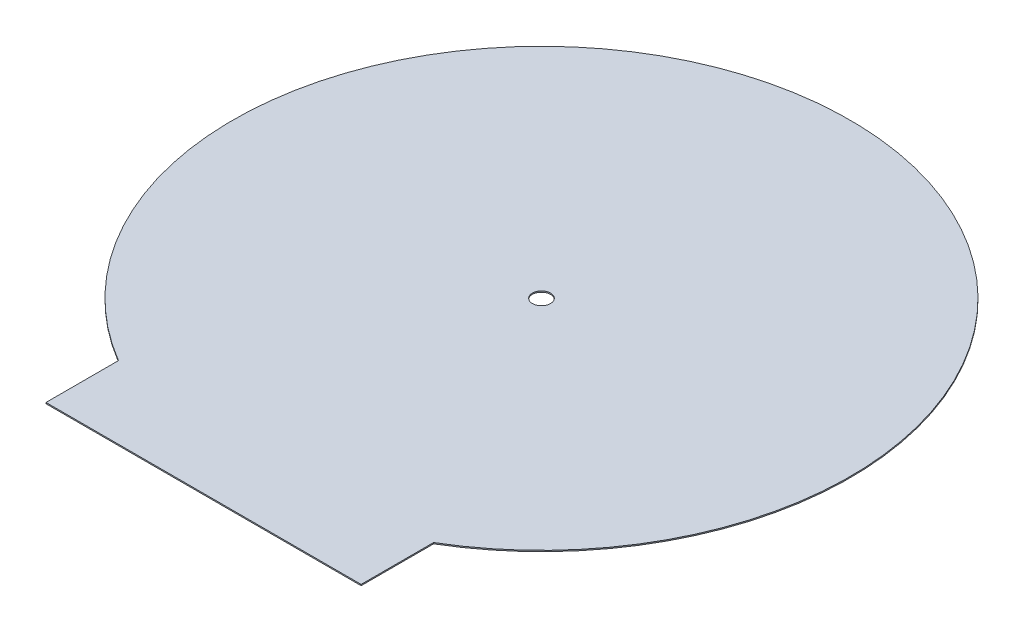
ISO-10303-21;
HEADER;
FILE_DESCRIPTION(('STEP AP214'),'2;1');
FILE_NAME('part.step','',(''),(''),'','','');
FILE_SCHEMA(('AUTOMOTIVE_DESIGN { 1 0 10303 214 1 1 1 1 }'));
ENDSEC;
DATA;
#1=APPLICATION_CONTEXT('core data for automotive mechanical design processes');
#2=APPLICATION_PROTOCOL_DEFINITION('international standard','automotive_design',2000,#1);
#3=PRODUCT_CONTEXT('',#1,'mechanical');
#4=PRODUCT('Part','Part','',(#3));
#5=PRODUCT_RELATED_PRODUCT_CATEGORY('part','',(#4));
#6=PRODUCT_DEFINITION_FORMATION('','',#4);
#7=PRODUCT_DEFINITION_CONTEXT('part definition',#1,'design');
#8=PRODUCT_DEFINITION('design','',#6,#7);
#9=PRODUCT_DEFINITION_SHAPE('','',#8);
#10=(LENGTH_UNIT() NAMED_UNIT(*) SI_UNIT(.MILLI.,.METRE.));
#11=(NAMED_UNIT(*) PLANE_ANGLE_UNIT() SI_UNIT($,.RADIAN.));
#12=(NAMED_UNIT(*) SI_UNIT($,.STERADIAN.) SOLID_ANGLE_UNIT());
#13=UNCERTAINTY_MEASURE_WITH_UNIT(LENGTH_MEASURE(1.E-05),#10,'distance_accuracy_value','');
#14=(GEOMETRIC_REPRESENTATION_CONTEXT(3) GLOBAL_UNCERTAINTY_ASSIGNED_CONTEXT((#13)) GLOBAL_UNIT_ASSIGNED_CONTEXT((#10,
#11,#12)) REPRESENTATION_CONTEXT('',''));
#15=CARTESIAN_POINT('',(0.,0.,0.));
#16=DIRECTION('',(0.,0.,1.));
#17=DIRECTION('',(1.,0.,0.));
#18=AXIS2_PLACEMENT_3D('',#15,#16,#17);
#19=CARTESIAN_POINT('',(-269.,851.,576.88772659299));
#20=DIRECTION('',(-1.,0.,0.));
#21=DIRECTION('',(0.,0.,1.));
#22=AXIS2_PLACEMENT_3D('',#19,#20,#21);
#23=PLANE('',#22);
#24=DIRECTION('',(0.,0.,1.));
#25=VECTOR('',#24,1.);
#26=CARTESIAN_POINT('',(-269.,853.,576.88772659299));
#27=LINE('',#26,#25);
#28=CARTESIAN_POINT('',(-269.,853.,453.175462707327));
#29=VERTEX_POINT('',#28);
#30=CARTESIAN_POINT('',(-269.,853.,576.88772659299));
#31=VERTEX_POINT('',#30);
#32=EDGE_CURVE('E101',#29,#31,#27,.T.);
#33=ORIENTED_EDGE('',*,*,#32,.F.);
#34=DIRECTION('',(0.,1.,0.));
#35=VECTOR('',#34,1.);
#36=CARTESIAN_POINT('',(-269.,851.,453.175462707327));
#37=LINE('',#36,#35);
#38=CARTESIAN_POINT('',(-269.,851.,453.175462707327));
#39=VERTEX_POINT('',#38);
#40=EDGE_CURVE('E11',#39,#29,#37,.T.);
#41=ORIENTED_EDGE('',*,*,#40,.F.);
#42=DIRECTION('',(0.,0.,1.));
#43=VECTOR('',#42,1.);
#44=CARTESIAN_POINT('',(-269.,851.,576.88772659299));
#45=LINE('',#44,#43);
#46=CARTESIAN_POINT('',(-269.,851.,576.88772659299));
#47=VERTEX_POINT('',#46);
#48=EDGE_CURVE('E94',#39,#47,#45,.T.);
#49=ORIENTED_EDGE('',*,*,#48,.T.);
#50=DIRECTION('',(0.,1.,0.));
#51=VECTOR('',#50,1.);
#52=CARTESIAN_POINT('',(-269.,851.,576.88772659299));
#53=LINE('',#52,#51);
#54=EDGE_CURVE('E39',#47,#31,#53,.T.);
#55=ORIENTED_EDGE('',*,*,#54,.T.);
#56=EDGE_LOOP('',(#33,#41,#49,#55));
#57=FACE_BOUND('',#56,.T.);
#58=ADVANCED_FACE('F36',(#57),#23,.T.);
#59=CARTESIAN_POINT('',(0.,851.,0.));
#60=DIRECTION('',(0.,1.,0.));
#61=DIRECTION('',(0.,0.,1.));
#62=AXIS2_PLACEMENT_3D('',#59,#60,#61);
#63=CYLINDRICAL_SURFACE('',#62,527.);
#64=CARTESIAN_POINT('',(0.,853.,0.));
#65=DIRECTION('',(0.,1.,0.));
#66=DIRECTION('',(0.,0.,1.));
#67=AXIS2_PLACEMENT_3D('',#64,#65,#66);
#68=CIRCLE('',#67,527.);
#69=CARTESIAN_POINT('',(269.,853.,453.175462707327));
#70=VERTEX_POINT('',#69);
#71=EDGE_CURVE('E96',#70,#29,#68,.T.);
#72=ORIENTED_EDGE('',*,*,#71,.F.);
#73=DIRECTION('',(0.,1.,0.));
#74=VECTOR('',#73,1.);
#75=CARTESIAN_POINT('',(269.,851.,453.175462707327));
#76=LINE('',#75,#74);
#77=CARTESIAN_POINT('',(269.,851.,453.175462707327));
#78=VERTEX_POINT('',#77);
#79=EDGE_CURVE('E45',#78,#70,#76,.T.);
#80=ORIENTED_EDGE('',*,*,#79,.F.);
#81=CARTESIAN_POINT('',(0.,851.,0.));
#82=DIRECTION('',(0.,1.,0.));
#83=DIRECTION('',(0.,0.,1.));
#84=AXIS2_PLACEMENT_3D('',#81,#82,#83);
#85=CIRCLE('',#84,527.);
#86=EDGE_CURVE('E91',#78,#39,#85,.T.);
#87=ORIENTED_EDGE('',*,*,#86,.T.);
#88=ORIENTED_EDGE('',*,*,#40,.T.);
#89=EDGE_LOOP('',(#72,#80,#87,#88));
#90=FACE_BOUND('',#89,.T.);
#91=ADVANCED_FACE('F112',(#90),#63,.T.);
#92=CARTESIAN_POINT('',(269.,851.,576.88772659299));
#93=DIRECTION('',(1.,0.,0.));
#94=DIRECTION('',(0.,0.,-1.));
#95=AXIS2_PLACEMENT_3D('',#92,#93,#94);
#96=PLANE('',#95);
#97=DIRECTION('',(0.,0.,-1.));
#98=VECTOR('',#97,1.);
#99=CARTESIAN_POINT('',(269.,853.,576.88772659299));
#100=LINE('',#99,#98);
#101=CARTESIAN_POINT('',(269.,853.,576.88772659299));
#102=VERTEX_POINT('',#101);
#103=EDGE_CURVE('E86',#102,#70,#100,.T.);
#104=ORIENTED_EDGE('',*,*,#103,.F.);
#105=DIRECTION('',(0.,1.,0.));
#106=VECTOR('',#105,1.);
#107=CARTESIAN_POINT('',(269.,851.,576.88772659299));
#108=LINE('',#107,#106);
#109=CARTESIAN_POINT('',(269.,851.,576.88772659299));
#110=VERTEX_POINT('',#109);
#111=EDGE_CURVE('E81',#110,#102,#108,.T.);
#112=ORIENTED_EDGE('',*,*,#111,.F.);
#113=DIRECTION('',(0.,0.,-1.));
#114=VECTOR('',#113,1.);
#115=CARTESIAN_POINT('',(269.,851.,576.88772659299));
#116=LINE('',#115,#114);
#117=EDGE_CURVE('E84',#110,#78,#116,.T.);
#118=ORIENTED_EDGE('',*,*,#117,.T.);
#119=ORIENTED_EDGE('',*,*,#79,.T.);
#120=EDGE_LOOP('',(#104,#112,#118,#119));
#121=FACE_BOUND('',#120,.T.);
#122=ADVANCED_FACE('F83',(#121),#96,.T.);
#123=CARTESIAN_POINT('',(-269.,851.,576.88772659299));
#124=DIRECTION('',(0.,0.,1.));
#125=DIRECTION('',(1.,0.,0.));
#126=AXIS2_PLACEMENT_3D('',#123,#124,#125);
#127=PLANE('',#126);
#128=DIRECTION('',(1.,0.,0.));
#129=VECTOR('',#128,1.);
#130=CARTESIAN_POINT('',(-269.,853.,576.88772659299));
#131=LINE('',#130,#129);
#132=EDGE_CURVE('E104',#31,#102,#131,.T.);
#133=ORIENTED_EDGE('',*,*,#132,.F.);
#134=ORIENTED_EDGE('',*,*,#54,.F.);
#135=DIRECTION('',(1.,0.,0.));
#136=VECTOR('',#135,1.);
#137=CARTESIAN_POINT('',(-269.,851.,576.88772659299));
#138=LINE('',#137,#136);
#139=EDGE_CURVE('E90',#47,#110,#138,.T.);
#140=ORIENTED_EDGE('',*,*,#139,.T.);
#141=ORIENTED_EDGE('',*,*,#111,.T.);
#142=EDGE_LOOP('',(#133,#134,#140,#141));
#143=FACE_BOUND('',#142,.T.);
#144=ADVANCED_FACE('F93',(#143),#127,.T.);
#145=CARTESIAN_POINT('',(0.,851.,0.));
#146=DIRECTION('',(0.,1.,0.));
#147=DIRECTION('',(0.,0.,1.));
#148=AXIS2_PLACEMENT_3D('',#145,#146,#147);
#149=PLANE('',#148);
#150=CARTESIAN_POINT('',(0.,851.,0.));
#151=DIRECTION('',(0.,1.,0.));
#152=DIRECTION('',(0.,0.,1.));
#153=AXIS2_PLACEMENT_3D('',#150,#151,#152);
#154=CIRCLE('',#153,15.5);
#155=CARTESIAN_POINT('',(0.,851.,15.5));
#156=VERTEX_POINT('',#155);
#157=EDGE_CURVE('E105',#156,#156,#154,.T.);
#158=ORIENTED_EDGE('',*,*,#157,.T.);
#159=EDGE_LOOP('',(#158));
#160=FACE_BOUND('',#159,.T.);
#161=ORIENTED_EDGE('',*,*,#48,.F.);
#162=ORIENTED_EDGE('',*,*,#86,.F.);
#163=ORIENTED_EDGE('',*,*,#117,.F.);
#164=ORIENTED_EDGE('',*,*,#139,.F.);
#165=EDGE_LOOP('',(#161,#162,#163,#164));
#166=FACE_BOUND('',#165,.T.);
#167=ADVANCED_FACE('F89',(#160,#166),#149,.F.);
#168=CARTESIAN_POINT('',(0.,853.,0.));
#169=DIRECTION('',(0.,1.,0.));
#170=DIRECTION('',(0.,0.,1.));
#171=AXIS2_PLACEMENT_3D('',#168,#169,#170);
#172=PLANE('',#171);
#173=CARTESIAN_POINT('',(0.,853.,0.));
#174=DIRECTION('',(0.,1.,0.));
#175=DIRECTION('',(0.,0.,1.));
#176=AXIS2_PLACEMENT_3D('',#173,#174,#175);
#177=CIRCLE('',#176,15.5);
#178=CARTESIAN_POINT('',(0.,853.,15.5));
#179=VERTEX_POINT('',#178);
#180=EDGE_CURVE('E142',#179,#179,#177,.T.);
#181=ORIENTED_EDGE('',*,*,#180,.F.);
#182=EDGE_LOOP('',(#181));
#183=FACE_BOUND('',#182,.T.);
#184=ORIENTED_EDGE('',*,*,#32,.T.);
#185=ORIENTED_EDGE('',*,*,#132,.T.);
#186=ORIENTED_EDGE('',*,*,#103,.T.);
#187=ORIENTED_EDGE('',*,*,#71,.T.);
#188=EDGE_LOOP('',(#184,#185,#186,#187));
#189=FACE_BOUND('',#188,.T.);
#190=ADVANCED_FACE('F111',(#183,#189),#172,.T.);
#191=CARTESIAN_POINT('',(0.,851.,0.));
#192=DIRECTION('',(0.,1.,0.));
#193=DIRECTION('',(0.,0.,1.));
#194=AXIS2_PLACEMENT_3D('',#191,#192,#193);
#195=CYLINDRICAL_SURFACE('',#194,15.5);
#196=ORIENTED_EDGE('',*,*,#157,.F.);
#197=EDGE_LOOP('',(#196));
#198=FACE_BOUND('',#197,.T.);
#199=ORIENTED_EDGE('',*,*,#180,.T.);
#200=EDGE_LOOP('',(#199));
#201=FACE_BOUND('',#200,.T.);
#202=ADVANCED_FACE('F130',(#198,#201),#195,.F.);
#203=CLOSED_SHELL('',(#58,#91,#122,#144,#167,#190,#202));
#204=MANIFOLD_SOLID_BREP('B2',#203);
#205=ADVANCED_BREP_SHAPE_REPRESENTATION('',(#18,#204),#14);
#206=SHAPE_DEFINITION_REPRESENTATION(#9,#205);
ENDSEC;
END-ISO-10303-21;
